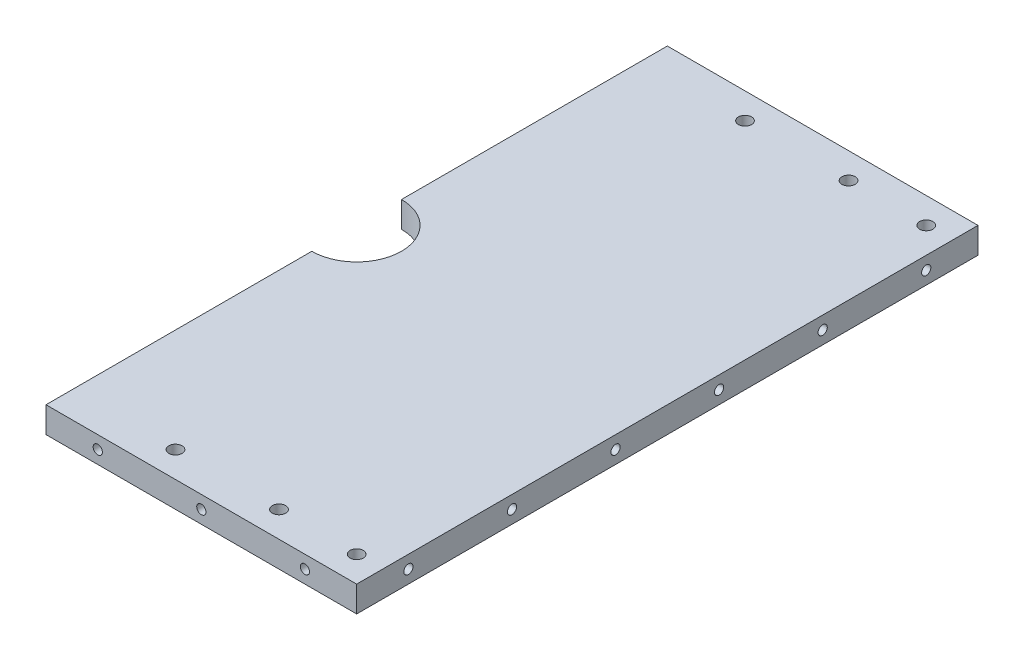
ISO-10303-21;
HEADER;
FILE_DESCRIPTION(('STEP AP214'),'2;1');
FILE_NAME('part.step','',(''),(''),'','','');
FILE_SCHEMA(('AUTOMOTIVE_DESIGN { 1 0 10303 214 1 1 1 1 }'));
ENDSEC;
DATA;
#1=APPLICATION_CONTEXT('core data for automotive mechanical design processes');
#2=APPLICATION_PROTOCOL_DEFINITION('international standard','automotive_design',2000,#1);
#3=PRODUCT_CONTEXT('',#1,'mechanical');
#4=PRODUCT('Part','Part','',(#3));
#5=PRODUCT_RELATED_PRODUCT_CATEGORY('part','',(#4));
#6=PRODUCT_DEFINITION_FORMATION('','',#4);
#7=PRODUCT_DEFINITION_CONTEXT('part definition',#1,'design');
#8=PRODUCT_DEFINITION('design','',#6,#7);
#9=PRODUCT_DEFINITION_SHAPE('','',#8);
#10=(LENGTH_UNIT() NAMED_UNIT(*) SI_UNIT(.MILLI.,.METRE.));
#11=(NAMED_UNIT(*) PLANE_ANGLE_UNIT() SI_UNIT($,.RADIAN.));
#12=(NAMED_UNIT(*) SI_UNIT($,.STERADIAN.) SOLID_ANGLE_UNIT());
#13=UNCERTAINTY_MEASURE_WITH_UNIT(LENGTH_MEASURE(1.E-05),#10,'distance_accuracy_value','');
#14=(GEOMETRIC_REPRESENTATION_CONTEXT(3) GLOBAL_UNCERTAINTY_ASSIGNED_CONTEXT((#13)) GLOBAL_UNIT_ASSIGNED_CONTEXT((#10,
#11,#12)) REPRESENTATION_CONTEXT('',''));
#15=CARTESIAN_POINT('',(0.,0.,0.));
#16=DIRECTION('',(0.,0.,1.));
#17=DIRECTION('',(1.,0.,0.));
#18=AXIS2_PLACEMENT_3D('',#15,#16,#17);
#19=CARTESIAN_POINT('',(0.,6.35,0.));
#20=DIRECTION('',(0.,1.,0.));
#21=DIRECTION('',(0.,0.,1.));
#22=AXIS2_PLACEMENT_3D('',#19,#20,#21);
#23=PLANE('',#22);
#24=CARTESIAN_POINT('',(50.8,6.35,69.85));
#25=DIRECTION('',(0.,1.,0.));
#26=DIRECTION('',(0.,0.,-1.));
#27=AXIS2_PLACEMENT_3D('',#24,#25,#26);
#28=CIRCLE('',#27,1.63194999999999);
#29=CARTESIAN_POINT('',(50.8,6.35,68.21805));
#30=VERTEX_POINT('',#29);
#31=EDGE_CURVE('E423',#30,#30,#28,.T.);
#32=ORIENTED_EDGE('',*,*,#31,.F.);
#33=EDGE_LOOP('',(#32));
#34=FACE_BOUND('',#33,.T.);
#35=CARTESIAN_POINT('',(50.8,6.35,-69.85));
#36=DIRECTION('',(0.,1.,0.));
#37=DIRECTION('',(0.,0.,1.));
#38=AXIS2_PLACEMENT_3D('',#35,#36,#37);
#39=CIRCLE('',#38,1.63194999999999);
#40=CARTESIAN_POINT('',(50.8,6.35,-68.21805));
#41=VERTEX_POINT('',#40);
#42=EDGE_CURVE('E439',#41,#41,#39,.T.);
#43=ORIENTED_EDGE('',*,*,#42,.F.);
#44=EDGE_LOOP('',(#43));
#45=FACE_BOUND('',#44,.T.);
#46=CARTESIAN_POINT('',(69.85,6.35,-69.85));
#47=DIRECTION('',(0.,1.,0.));
#48=DIRECTION('',(0.,0.,1.));
#49=AXIS2_PLACEMENT_3D('',#46,#47,#48);
#50=CIRCLE('',#49,1.63194999999999);
#51=CARTESIAN_POINT('',(69.85,6.35,-68.21805));
#52=VERTEX_POINT('',#51);
#53=EDGE_CURVE('E143',#52,#52,#50,.T.);
#54=ORIENTED_EDGE('',*,*,#53,.F.);
#55=EDGE_LOOP('',(#54));
#56=FACE_BOUND('',#55,.T.);
#57=DIRECTION('',(0.,0.,1.));
#58=VECTOR('',#57,1.);
#59=CARTESIAN_POINT('',(0.,6.35,-76.2));
#60=LINE('',#59,#58);
#61=CARTESIAN_POINT('',(0.,6.35,-76.2));
#62=VERTEX_POINT('',#61);
#63=CARTESIAN_POINT('',(0.,6.35,-11.));
#64=VERTEX_POINT('',#63);
#65=EDGE_CURVE('E155',#62,#64,#60,.T.);
#66=ORIENTED_EDGE('',*,*,#65,.T.);
#67=CARTESIAN_POINT('',(0.,6.35,0.));
#68=DIRECTION('',(0.,-1.,0.));
#69=DIRECTION('',(0.,0.,1.));
#70=AXIS2_PLACEMENT_3D('',#67,#68,#69);
#71=CIRCLE('',#70,11.);
#72=CARTESIAN_POINT('',(0.,6.35,11.));
#73=VERTEX_POINT('',#72);
#74=EDGE_CURVE('E101',#64,#73,#71,.T.);
#75=ORIENTED_EDGE('',*,*,#74,.T.);
#76=DIRECTION('',(0.,0.,1.));
#77=VECTOR('',#76,1.);
#78=CARTESIAN_POINT('',(0.,6.35,11.));
#79=LINE('',#78,#77);
#80=CARTESIAN_POINT('',(0.,6.35,76.2));
#81=VERTEX_POINT('',#80);
#82=EDGE_CURVE('E116',#73,#81,#79,.T.);
#83=ORIENTED_EDGE('',*,*,#82,.T.);
#84=DIRECTION('',(1.,0.,0.));
#85=VECTOR('',#84,1.);
#86=CARTESIAN_POINT('',(0.,6.35,76.2));
#87=LINE('',#86,#85);
#88=CARTESIAN_POINT('',(76.2,6.35,76.2));
#89=VERTEX_POINT('',#88);
#90=EDGE_CURVE('E110',#81,#89,#87,.T.);
#91=ORIENTED_EDGE('',*,*,#90,.T.);
#92=DIRECTION('',(0.,0.,-1.));
#93=VECTOR('',#92,1.);
#94=CARTESIAN_POINT('',(76.2,6.35,-76.2));
#95=LINE('',#94,#93);
#96=CARTESIAN_POINT('',(76.2,6.35,-76.2));
#97=VERTEX_POINT('',#96);
#98=EDGE_CURVE('E114',#89,#97,#95,.T.);
#99=ORIENTED_EDGE('',*,*,#98,.T.);
#100=DIRECTION('',(-1.,0.,0.));
#101=VECTOR('',#100,1.);
#102=CARTESIAN_POINT('',(0.,6.35,-76.2));
#103=LINE('',#102,#101);
#104=EDGE_CURVE('E63',#97,#62,#103,.T.);
#105=ORIENTED_EDGE('',*,*,#104,.T.);
#106=EDGE_LOOP('',(#66,#75,#83,#91,#99,#105));
#107=FACE_BOUND('',#106,.T.);
#108=CARTESIAN_POINT('',(69.85,6.35,69.85));
#109=DIRECTION('',(0.,1.,0.));
#110=DIRECTION('',(0.,0.,-1.));
#111=AXIS2_PLACEMENT_3D('',#108,#109,#110);
#112=CIRCLE('',#111,1.63194999999999);
#113=CARTESIAN_POINT('',(69.85,6.35,68.21805));
#114=VERTEX_POINT('',#113);
#115=EDGE_CURVE('E447',#114,#114,#112,.T.);
#116=ORIENTED_EDGE('',*,*,#115,.F.);
#117=EDGE_LOOP('',(#116));
#118=FACE_BOUND('',#117,.T.);
#119=CARTESIAN_POINT('',(25.4,6.35,-69.85));
#120=DIRECTION('',(0.,1.,0.));
#121=DIRECTION('',(0.,0.,1.));
#122=AXIS2_PLACEMENT_3D('',#119,#120,#121);
#123=CIRCLE('',#122,1.63195);
#124=CARTESIAN_POINT('',(25.4,6.35,-68.21805));
#125=VERTEX_POINT('',#124);
#126=EDGE_CURVE('E431',#125,#125,#123,.T.);
#127=ORIENTED_EDGE('',*,*,#126,.F.);
#128=EDGE_LOOP('',(#127));
#129=FACE_BOUND('',#128,.T.);
#130=CARTESIAN_POINT('',(25.4,6.35,69.85));
#131=DIRECTION('',(0.,1.,0.));
#132=DIRECTION('',(0.,0.,-1.));
#133=AXIS2_PLACEMENT_3D('',#130,#131,#132);
#134=CIRCLE('',#133,1.63195);
#135=CARTESIAN_POINT('',(25.4,6.35,68.21805));
#136=VERTEX_POINT('',#135);
#137=EDGE_CURVE('E415',#136,#136,#134,.T.);
#138=ORIENTED_EDGE('',*,*,#137,.F.);
#139=EDGE_LOOP('',(#138));
#140=FACE_BOUND('',#139,.T.);
#141=ADVANCED_FACE('F45',(#34,#45,#56,#107,#118,#129,#140),#23,.T.);
#142=CARTESIAN_POINT('',(0.,0.,0.));
#143=DIRECTION('',(0.,1.,0.));
#144=DIRECTION('',(0.,0.,1.));
#145=AXIS2_PLACEMENT_3D('',#142,#143,#144);
#146=PLANE('',#145);
#147=DIRECTION('',(0.,0.,1.));
#148=VECTOR('',#147,1.);
#149=CARTESIAN_POINT('',(0.,0.,-76.2));
#150=LINE('',#149,#148);
#151=CARTESIAN_POINT('',(0.,0.,-76.2));
#152=VERTEX_POINT('',#151);
#153=CARTESIAN_POINT('',(0.,0.,-11.));
#154=VERTEX_POINT('',#153);
#155=EDGE_CURVE('E138',#152,#154,#150,.T.);
#156=ORIENTED_EDGE('',*,*,#155,.F.);
#157=DIRECTION('',(-1.,0.,0.));
#158=VECTOR('',#157,1.);
#159=CARTESIAN_POINT('',(0.,0.,-76.2));
#160=LINE('',#159,#158);
#161=CARTESIAN_POINT('',(76.2,0.,-76.2));
#162=VERTEX_POINT('',#161);
#163=EDGE_CURVE('E93',#162,#152,#160,.T.);
#164=ORIENTED_EDGE('',*,*,#163,.F.);
#165=DIRECTION('',(0.,0.,-1.));
#166=VECTOR('',#165,1.);
#167=CARTESIAN_POINT('',(76.2,0.,-76.2));
#168=LINE('',#167,#166);
#169=CARTESIAN_POINT('',(76.2,0.,76.2));
#170=VERTEX_POINT('',#169);
#171=EDGE_CURVE('E87',#170,#162,#168,.T.);
#172=ORIENTED_EDGE('',*,*,#171,.F.);
#173=DIRECTION('',(1.,0.,0.));
#174=VECTOR('',#173,1.);
#175=CARTESIAN_POINT('',(0.,0.,76.2));
#176=LINE('',#175,#174);
#177=CARTESIAN_POINT('',(0.,0.,76.2));
#178=VERTEX_POINT('',#177);
#179=EDGE_CURVE('E125',#178,#170,#176,.T.);
#180=ORIENTED_EDGE('',*,*,#179,.F.);
#181=DIRECTION('',(0.,0.,1.));
#182=VECTOR('',#181,1.);
#183=CARTESIAN_POINT('',(0.,0.,11.));
#184=LINE('',#183,#182);
#185=CARTESIAN_POINT('',(0.,0.,11.));
#186=VERTEX_POINT('',#185);
#187=EDGE_CURVE('E146',#186,#178,#184,.T.);
#188=ORIENTED_EDGE('',*,*,#187,.F.);
#189=CARTESIAN_POINT('',(0.,0.,0.));
#190=DIRECTION('',(0.,-1.,0.));
#191=DIRECTION('',(0.,0.,1.));
#192=AXIS2_PLACEMENT_3D('',#189,#190,#191);
#193=CIRCLE('',#192,11.);
#194=EDGE_CURVE('E142',#154,#186,#193,.T.);
#195=ORIENTED_EDGE('',*,*,#194,.F.);
#196=EDGE_LOOP('',(#156,#164,#172,#180,#188,#195));
#197=FACE_BOUND('',#196,.T.);
#198=CARTESIAN_POINT('',(69.85,0.,-69.85));
#199=DIRECTION('',(0.,1.,0.));
#200=DIRECTION('',(0.,0.,1.));
#201=AXIS2_PLACEMENT_3D('',#198,#199,#200);
#202=CIRCLE('',#201,1.63194999999999);
#203=CARTESIAN_POINT('',(69.85,0.,-68.21805));
#204=VERTEX_POINT('',#203);
#205=EDGE_CURVE('E451',#204,#204,#202,.T.);
#206=ORIENTED_EDGE('',*,*,#205,.T.);
#207=EDGE_LOOP('',(#206));
#208=FACE_BOUND('',#207,.T.);
#209=CARTESIAN_POINT('',(69.85,0.,69.85));
#210=DIRECTION('',(0.,1.,0.));
#211=DIRECTION('',(0.,0.,-1.));
#212=AXIS2_PLACEMENT_3D('',#209,#210,#211);
#213=CIRCLE('',#212,1.63194999999999);
#214=CARTESIAN_POINT('',(69.85,0.,68.21805));
#215=VERTEX_POINT('',#214);
#216=EDGE_CURVE('E443',#215,#215,#213,.T.);
#217=ORIENTED_EDGE('',*,*,#216,.T.);
#218=EDGE_LOOP('',(#217));
#219=FACE_BOUND('',#218,.T.);
#220=CARTESIAN_POINT('',(50.8,0.,-69.85));
#221=DIRECTION('',(0.,1.,0.));
#222=DIRECTION('',(0.,0.,1.));
#223=AXIS2_PLACEMENT_3D('',#220,#221,#222);
#224=CIRCLE('',#223,1.63194999999999);
#225=CARTESIAN_POINT('',(50.8,0.,-68.21805));
#226=VERTEX_POINT('',#225);
#227=EDGE_CURVE('E435',#226,#226,#224,.T.);
#228=ORIENTED_EDGE('',*,*,#227,.T.);
#229=EDGE_LOOP('',(#228));
#230=FACE_BOUND('',#229,.T.);
#231=CARTESIAN_POINT('',(25.4,0.,-69.85));
#232=DIRECTION('',(0.,1.,0.));
#233=DIRECTION('',(0.,0.,1.));
#234=AXIS2_PLACEMENT_3D('',#231,#232,#233);
#235=CIRCLE('',#234,1.63195);
#236=CARTESIAN_POINT('',(25.4,0.,-68.21805));
#237=VERTEX_POINT('',#236);
#238=EDGE_CURVE('E427',#237,#237,#235,.T.);
#239=ORIENTED_EDGE('',*,*,#238,.T.);
#240=EDGE_LOOP('',(#239));
#241=FACE_BOUND('',#240,.T.);
#242=CARTESIAN_POINT('',(50.8,0.,69.85));
#243=DIRECTION('',(0.,1.,0.));
#244=DIRECTION('',(0.,0.,-1.));
#245=AXIS2_PLACEMENT_3D('',#242,#243,#244);
#246=CIRCLE('',#245,1.63194999999999);
#247=CARTESIAN_POINT('',(50.8,0.,68.21805));
#248=VERTEX_POINT('',#247);
#249=EDGE_CURVE('E419',#248,#248,#246,.T.);
#250=ORIENTED_EDGE('',*,*,#249,.T.);
#251=EDGE_LOOP('',(#250));
#252=FACE_BOUND('',#251,.T.);
#253=CARTESIAN_POINT('',(25.4,0.,69.85));
#254=DIRECTION('',(0.,1.,0.));
#255=DIRECTION('',(0.,0.,-1.));
#256=AXIS2_PLACEMENT_3D('',#253,#254,#255);
#257=CIRCLE('',#256,1.63195);
#258=CARTESIAN_POINT('',(25.4,0.,68.21805));
#259=VERTEX_POINT('',#258);
#260=EDGE_CURVE('E414',#259,#259,#257,.T.);
#261=ORIENTED_EDGE('',*,*,#260,.T.);
#262=EDGE_LOOP('',(#261));
#263=FACE_BOUND('',#262,.T.);
#264=ADVANCED_FACE('F168',(#197,#208,#219,#230,#241,#252,#263),#146,.F.);
#265=CARTESIAN_POINT('',(0.,6.35,-76.2));
#266=DIRECTION('',(1.,0.,0.));
#267=DIRECTION('',(0.,0.,-1.));
#268=AXIS2_PLACEMENT_3D('',#265,#266,#267);
#269=PLANE('',#268);
#270=ORIENTED_EDGE('',*,*,#155,.T.);
#271=DIRECTION('',(0.,-1.,0.));
#272=VECTOR('',#271,1.);
#273=CARTESIAN_POINT('',(0.,6.35,-11.));
#274=LINE('',#273,#272);
#275=EDGE_CURVE('E11',#64,#154,#274,.T.);
#276=ORIENTED_EDGE('',*,*,#275,.F.);
#277=ORIENTED_EDGE('',*,*,#65,.F.);
#278=DIRECTION('',(0.,-1.,0.));
#279=VECTOR('',#278,1.);
#280=CARTESIAN_POINT('',(0.,6.35,-76.2));
#281=LINE('',#280,#279);
#282=EDGE_CURVE('E134',#62,#152,#281,.T.);
#283=ORIENTED_EDGE('',*,*,#282,.T.);
#284=EDGE_LOOP('',(#270,#276,#277,#283));
#285=FACE_BOUND('',#284,.T.);
#286=ADVANCED_FACE('F47',(#285),#269,.F.);
#287=CARTESIAN_POINT('',(0.,6.35,0.));
#288=DIRECTION('',(0.,-1.,0.));
#289=DIRECTION('',(0.,0.,-1.));
#290=AXIS2_PLACEMENT_3D('',#287,#288,#289);
#291=CYLINDRICAL_SURFACE('',#290,11.);
#292=ORIENTED_EDGE('',*,*,#194,.T.);
#293=DIRECTION('',(0.,-1.,0.));
#294=VECTOR('',#293,1.);
#295=CARTESIAN_POINT('',(0.,6.35,11.));
#296=LINE('',#295,#294);
#297=EDGE_CURVE('E55',#73,#186,#296,.T.);
#298=ORIENTED_EDGE('',*,*,#297,.F.);
#299=ORIENTED_EDGE('',*,*,#74,.F.);
#300=ORIENTED_EDGE('',*,*,#275,.T.);
#301=EDGE_LOOP('',(#292,#298,#299,#300));
#302=FACE_BOUND('',#301,.T.);
#303=ADVANCED_FACE('F530',(#302),#291,.F.);
#304=CARTESIAN_POINT('',(0.,6.35,11.));
#305=DIRECTION('',(1.,0.,0.));
#306=DIRECTION('',(0.,0.,-1.));
#307=AXIS2_PLACEMENT_3D('',#304,#305,#306);
#308=PLANE('',#307);
#309=ORIENTED_EDGE('',*,*,#187,.T.);
#310=DIRECTION('',(0.,-1.,0.));
#311=VECTOR('',#310,1.);
#312=CARTESIAN_POINT('',(0.,6.35,76.2));
#313=LINE('',#312,#311);
#314=EDGE_CURVE('E127',#81,#178,#313,.T.);
#315=ORIENTED_EDGE('',*,*,#314,.F.);
#316=ORIENTED_EDGE('',*,*,#82,.F.);
#317=ORIENTED_EDGE('',*,*,#297,.T.);
#318=EDGE_LOOP('',(#309,#315,#316,#317));
#319=FACE_BOUND('',#318,.T.);
#320=ADVANCED_FACE('F165',(#319),#308,.F.);
#321=CARTESIAN_POINT('',(0.,6.35,76.2));
#322=DIRECTION('',(0.,0.,-1.));
#323=DIRECTION('',(-1.,0.,0.));
#324=AXIS2_PLACEMENT_3D('',#321,#322,#323);
#325=PLANE('',#324);
#326=CARTESIAN_POINT('',(12.7,3.175,76.2));
#327=DIRECTION('',(0.,0.,1.));
#328=DIRECTION('',(1.,0.,0.));
#329=AXIS2_PLACEMENT_3D('',#326,#327,#328);
#330=CIRCLE('',#329,1.13029999999999);
#331=CARTESIAN_POINT('',(13.8303,3.175,76.2));
#332=VERTEX_POINT('',#331);
#333=EDGE_CURVE('E342',#332,#332,#330,.T.);
#334=ORIENTED_EDGE('',*,*,#333,.F.);
#335=EDGE_LOOP('',(#334));
#336=FACE_BOUND('',#335,.T.);
#337=CARTESIAN_POINT('',(38.1,3.175,76.2));
#338=DIRECTION('',(0.,0.,1.));
#339=DIRECTION('',(1.,0.,0.));
#340=AXIS2_PLACEMENT_3D('',#337,#338,#339);
#341=CIRCLE('',#340,1.13029999999999);
#342=CARTESIAN_POINT('',(39.2303,3.175,76.2));
#343=VERTEX_POINT('',#342);
#344=EDGE_CURVE('E350',#343,#343,#341,.T.);
#345=ORIENTED_EDGE('',*,*,#344,.F.);
#346=EDGE_LOOP('',(#345));
#347=FACE_BOUND('',#346,.T.);
#348=CARTESIAN_POINT('',(63.5,3.175,76.2));
#349=DIRECTION('',(0.,0.,1.));
#350=DIRECTION('',(1.,0.,0.));
#351=AXIS2_PLACEMENT_3D('',#348,#349,#350);
#352=CIRCLE('',#351,1.13029999999999);
#353=CARTESIAN_POINT('',(64.6303,3.175,76.2));
#354=VERTEX_POINT('',#353);
#355=EDGE_CURVE('E358',#354,#354,#352,.T.);
#356=ORIENTED_EDGE('',*,*,#355,.F.);
#357=EDGE_LOOP('',(#356));
#358=FACE_BOUND('',#357,.T.);
#359=ORIENTED_EDGE('',*,*,#179,.T.);
#360=DIRECTION('',(0.,-1.,0.));
#361=VECTOR('',#360,1.);
#362=CARTESIAN_POINT('',(76.2,6.35,76.2));
#363=LINE('',#362,#361);
#364=EDGE_CURVE('E122',#89,#170,#363,.T.);
#365=ORIENTED_EDGE('',*,*,#364,.F.);
#366=ORIENTED_EDGE('',*,*,#90,.F.);
#367=ORIENTED_EDGE('',*,*,#314,.T.);
#368=EDGE_LOOP('',(#359,#365,#366,#367));
#369=FACE_BOUND('',#368,.T.);
#370=ADVANCED_FACE('F123',(#336,#347,#358,#369),#325,.F.);
#371=CARTESIAN_POINT('',(76.2,6.35,-76.2));
#372=DIRECTION('',(-1.,0.,0.));
#373=DIRECTION('',(0.,0.,1.));
#374=AXIS2_PLACEMENT_3D('',#371,#372,#373);
#375=PLANE('',#374);
#376=CARTESIAN_POINT('',(76.2,3.175,-63.5));
#377=DIRECTION('',(1.,0.,0.));
#378=DIRECTION('',(0.,0.,-1.));
#379=AXIS2_PLACEMENT_3D('',#376,#377,#378);
#380=CIRCLE('',#379,1.1303);
#381=CARTESIAN_POINT('',(76.2,3.175,-64.6303));
#382=VERTEX_POINT('',#381);
#383=EDGE_CURVE('E366',#382,#382,#380,.T.);
#384=ORIENTED_EDGE('',*,*,#383,.F.);
#385=EDGE_LOOP('',(#384));
#386=FACE_BOUND('',#385,.T.);
#387=CARTESIAN_POINT('',(76.2,3.175,-38.1));
#388=DIRECTION('',(1.,0.,0.));
#389=DIRECTION('',(0.,0.,-1.));
#390=AXIS2_PLACEMENT_3D('',#387,#388,#389);
#391=CIRCLE('',#390,1.1303);
#392=CARTESIAN_POINT('',(76.2,3.175,-39.2303));
#393=VERTEX_POINT('',#392);
#394=EDGE_CURVE('E374',#393,#393,#391,.T.);
#395=ORIENTED_EDGE('',*,*,#394,.F.);
#396=EDGE_LOOP('',(#395));
#397=FACE_BOUND('',#396,.T.);
#398=CARTESIAN_POINT('',(76.2,3.175,-12.7));
#399=DIRECTION('',(1.,0.,0.));
#400=DIRECTION('',(0.,0.,-1.));
#401=AXIS2_PLACEMENT_3D('',#398,#399,#400);
#402=CIRCLE('',#401,1.1303);
#403=CARTESIAN_POINT('',(76.2,3.175,-13.8303));
#404=VERTEX_POINT('',#403);
#405=EDGE_CURVE('E382',#404,#404,#402,.T.);
#406=ORIENTED_EDGE('',*,*,#405,.F.);
#407=EDGE_LOOP('',(#406));
#408=FACE_BOUND('',#407,.T.);
#409=CARTESIAN_POINT('',(76.2,3.175,12.7));
#410=DIRECTION('',(1.,0.,0.));
#411=DIRECTION('',(0.,0.,-1.));
#412=AXIS2_PLACEMENT_3D('',#409,#410,#411);
#413=CIRCLE('',#412,1.1303);
#414=CARTESIAN_POINT('',(76.2,3.175,11.5697));
#415=VERTEX_POINT('',#414);
#416=EDGE_CURVE('E390',#415,#415,#413,.T.);
#417=ORIENTED_EDGE('',*,*,#416,.F.);
#418=EDGE_LOOP('',(#417));
#419=FACE_BOUND('',#418,.T.);
#420=CARTESIAN_POINT('',(76.2,3.175,38.1));
#421=DIRECTION('',(1.,0.,0.));
#422=DIRECTION('',(0.,0.,-1.));
#423=AXIS2_PLACEMENT_3D('',#420,#421,#422);
#424=CIRCLE('',#423,1.1303);
#425=CARTESIAN_POINT('',(76.2,3.175,36.9697));
#426=VERTEX_POINT('',#425);
#427=EDGE_CURVE('E398',#426,#426,#424,.T.);
#428=ORIENTED_EDGE('',*,*,#427,.F.);
#429=EDGE_LOOP('',(#428));
#430=FACE_BOUND('',#429,.T.);
#431=CARTESIAN_POINT('',(76.2,3.175,63.5));
#432=DIRECTION('',(1.,0.,0.));
#433=DIRECTION('',(0.,0.,-1.));
#434=AXIS2_PLACEMENT_3D('',#431,#432,#433);
#435=CIRCLE('',#434,1.1303);
#436=CARTESIAN_POINT('',(76.2,3.175,62.3697));
#437=VERTEX_POINT('',#436);
#438=EDGE_CURVE('E406',#437,#437,#435,.T.);
#439=ORIENTED_EDGE('',*,*,#438,.F.);
#440=EDGE_LOOP('',(#439));
#441=FACE_BOUND('',#440,.T.);
#442=ORIENTED_EDGE('',*,*,#171,.T.);
#443=DIRECTION('',(0.,-1.,0.));
#444=VECTOR('',#443,1.);
#445=CARTESIAN_POINT('',(76.2,6.35,-76.2));
#446=LINE('',#445,#444);
#447=EDGE_CURVE('E128',#97,#162,#446,.T.);
#448=ORIENTED_EDGE('',*,*,#447,.F.);
#449=ORIENTED_EDGE('',*,*,#98,.F.);
#450=ORIENTED_EDGE('',*,*,#364,.T.);
#451=EDGE_LOOP('',(#442,#448,#449,#450));
#452=FACE_BOUND('',#451,.T.);
#453=ADVANCED_FACE('F130',(#386,#397,#408,#419,#430,#441,#452),#375,.F.);
#454=CARTESIAN_POINT('',(0.,6.35,-76.2));
#455=DIRECTION('',(0.,0.,1.));
#456=DIRECTION('',(1.,0.,0.));
#457=AXIS2_PLACEMENT_3D('',#454,#455,#456);
#458=PLANE('',#457);
#459=CARTESIAN_POINT('',(12.7,3.175,-76.2));
#460=DIRECTION('',(0.,0.,-1.));
#461=DIRECTION('',(-1.,0.,0.));
#462=AXIS2_PLACEMENT_3D('',#459,#460,#461);
#463=CIRCLE('',#462,1.13029999999999);
#464=CARTESIAN_POINT('',(11.5697,3.175,-76.2));
#465=VERTEX_POINT('',#464);
#466=EDGE_CURVE('E320',#465,#465,#463,.T.);
#467=ORIENTED_EDGE('',*,*,#466,.F.);
#468=EDGE_LOOP('',(#467));
#469=FACE_BOUND('',#468,.T.);
#470=CARTESIAN_POINT('',(38.1,3.175,-76.2));
#471=DIRECTION('',(0.,0.,-1.));
#472=DIRECTION('',(-1.,0.,0.));
#473=AXIS2_PLACEMENT_3D('',#470,#471,#472);
#474=CIRCLE('',#473,1.13029999999999);
#475=CARTESIAN_POINT('',(36.9697,3.175,-76.2));
#476=VERTEX_POINT('',#475);
#477=EDGE_CURVE('E324',#476,#476,#474,.T.);
#478=ORIENTED_EDGE('',*,*,#477,.F.);
#479=EDGE_LOOP('',(#478));
#480=FACE_BOUND('',#479,.T.);
#481=CARTESIAN_POINT('',(63.5,3.175,-76.2));
#482=DIRECTION('',(0.,0.,-1.));
#483=DIRECTION('',(-1.,0.,0.));
#484=AXIS2_PLACEMENT_3D('',#481,#482,#483);
#485=CIRCLE('',#484,1.13029999999999);
#486=CARTESIAN_POINT('',(62.3697,3.175,-76.2));
#487=VERTEX_POINT('',#486);
#488=EDGE_CURVE('E334',#487,#487,#485,.T.);
#489=ORIENTED_EDGE('',*,*,#488,.F.);
#490=EDGE_LOOP('',(#489));
#491=FACE_BOUND('',#490,.T.);
#492=ORIENTED_EDGE('',*,*,#163,.T.);
#493=ORIENTED_EDGE('',*,*,#282,.F.);
#494=ORIENTED_EDGE('',*,*,#104,.F.);
#495=ORIENTED_EDGE('',*,*,#447,.T.);
#496=EDGE_LOOP('',(#492,#493,#494,#495));
#497=FACE_BOUND('',#496,.T.);
#498=ADVANCED_FACE('F173',(#469,#480,#491,#497),#458,.F.);
#499=CARTESIAN_POINT('',(69.85,6.35,-69.85));
#500=DIRECTION('',(0.,-1.,0.));
#501=DIRECTION('',(0.,0.,-1.));
#502=AXIS2_PLACEMENT_3D('',#499,#500,#501);
#503=CYLINDRICAL_SURFACE('',#502,1.63194999999999);
#504=ORIENTED_EDGE('',*,*,#53,.T.);
#505=EDGE_LOOP('',(#504));
#506=FACE_BOUND('',#505,.T.);
#507=ORIENTED_EDGE('',*,*,#205,.F.);
#508=EDGE_LOOP('',(#507));
#509=FACE_BOUND('',#508,.T.);
#510=ADVANCED_FACE('F175',(#506,#509),#503,.F.);
#511=CARTESIAN_POINT('',(69.85,6.35,69.85));
#512=DIRECTION('',(0.,-1.,0.));
#513=DIRECTION('',(0.,0.,-1.));
#514=AXIS2_PLACEMENT_3D('',#511,#512,#513);
#515=CYLINDRICAL_SURFACE('',#514,1.63194999999999);
#516=ORIENTED_EDGE('',*,*,#115,.T.);
#517=EDGE_LOOP('',(#516));
#518=FACE_BOUND('',#517,.T.);
#519=ORIENTED_EDGE('',*,*,#216,.F.);
#520=EDGE_LOOP('',(#519));
#521=FACE_BOUND('',#520,.T.);
#522=ADVANCED_FACE('F182',(#518,#521),#515,.F.);
#523=CARTESIAN_POINT('',(50.8,6.35,-69.85));
#524=DIRECTION('',(0.,-1.,0.));
#525=DIRECTION('',(0.,0.,-1.));
#526=AXIS2_PLACEMENT_3D('',#523,#524,#525);
#527=CYLINDRICAL_SURFACE('',#526,1.63194999999999);
#528=ORIENTED_EDGE('',*,*,#42,.T.);
#529=EDGE_LOOP('',(#528));
#530=FACE_BOUND('',#529,.T.);
#531=ORIENTED_EDGE('',*,*,#227,.F.);
#532=EDGE_LOOP('',(#531));
#533=FACE_BOUND('',#532,.T.);
#534=ADVANCED_FACE('F201',(#530,#533),#527,.F.);
#535=CARTESIAN_POINT('',(25.4,6.35,-69.85));
#536=DIRECTION('',(0.,-1.,0.));
#537=DIRECTION('',(0.,0.,-1.));
#538=AXIS2_PLACEMENT_3D('',#535,#536,#537);
#539=CYLINDRICAL_SURFACE('',#538,1.63195);
#540=ORIENTED_EDGE('',*,*,#126,.T.);
#541=EDGE_LOOP('',(#540));
#542=FACE_BOUND('',#541,.T.);
#543=ORIENTED_EDGE('',*,*,#238,.F.);
#544=EDGE_LOOP('',(#543));
#545=FACE_BOUND('',#544,.T.);
#546=ADVANCED_FACE('F205',(#542,#545),#539,.F.);
#547=CARTESIAN_POINT('',(50.8,6.35,69.85));
#548=DIRECTION('',(0.,-1.,0.));
#549=DIRECTION('',(0.,0.,-1.));
#550=AXIS2_PLACEMENT_3D('',#547,#548,#549);
#551=CYLINDRICAL_SURFACE('',#550,1.63194999999999);
#552=ORIENTED_EDGE('',*,*,#31,.T.);
#553=EDGE_LOOP('',(#552));
#554=FACE_BOUND('',#553,.T.);
#555=ORIENTED_EDGE('',*,*,#249,.F.);
#556=EDGE_LOOP('',(#555));
#557=FACE_BOUND('',#556,.T.);
#558=ADVANCED_FACE('F209',(#554,#557),#551,.F.);
#559=CARTESIAN_POINT('',(25.4,6.35,69.85));
#560=DIRECTION('',(0.,-1.,0.));
#561=DIRECTION('',(0.,0.,-1.));
#562=AXIS2_PLACEMENT_3D('',#559,#560,#561);
#563=CYLINDRICAL_SURFACE('',#562,1.63195);
#564=ORIENTED_EDGE('',*,*,#137,.T.);
#565=EDGE_LOOP('',(#564));
#566=FACE_BOUND('',#565,.T.);
#567=ORIENTED_EDGE('',*,*,#260,.F.);
#568=EDGE_LOOP('',(#567));
#569=FACE_BOUND('',#568,.T.);
#570=ADVANCED_FACE('F213',(#566,#569),#563,.F.);
#571=CARTESIAN_POINT('',(68.6,3.175,63.5));
#572=DIRECTION('',(1.,0.,0.));
#573=DIRECTION('',(0.,0.,-1.));
#574=AXIS2_PLACEMENT_3D('',#571,#572,#573);
#575=CONICAL_SURFACE('',#574,1.1303,1.02974425867665);
#576=CARTESIAN_POINT('',(67.9208472423132,3.175,63.5));
#577=VERTEX_POINT('',#576);
#578=VERTEX_LOOP('',#577);
#579=FACE_BOUND('',#578,.T.);
#580=CARTESIAN_POINT('',(68.6,3.175,63.5));
#581=DIRECTION('',(1.,0.,0.));
#582=DIRECTION('',(0.,0.,-1.));
#583=AXIS2_PLACEMENT_3D('',#580,#581,#582);
#584=CIRCLE('',#583,1.1303);
#585=CARTESIAN_POINT('',(68.6,3.175,62.3697));
#586=VERTEX_POINT('',#585);
#587=EDGE_CURVE('E410',#586,#586,#584,.T.);
#588=ORIENTED_EDGE('',*,*,#587,.T.);
#589=EDGE_LOOP('',(#588));
#590=FACE_BOUND('',#589,.T.);
#591=ADVANCED_FACE('F217',(#579,#590),#575,.F.);
#592=CARTESIAN_POINT('',(76.2,3.175,63.5));
#593=DIRECTION('',(1.,0.,0.));
#594=DIRECTION('',(0.,0.,-1.));
#595=AXIS2_PLACEMENT_3D('',#592,#593,#594);
#596=CYLINDRICAL_SURFACE('',#595,1.1303);
#597=ORIENTED_EDGE('',*,*,#587,.F.);
#598=EDGE_LOOP('',(#597));
#599=FACE_BOUND('',#598,.T.);
#600=ORIENTED_EDGE('',*,*,#438,.T.);
#601=EDGE_LOOP('',(#600));
#602=FACE_BOUND('',#601,.T.);
#603=ADVANCED_FACE('F221',(#599,#602),#596,.F.);
#604=CARTESIAN_POINT('',(68.6,3.175,38.1));
#605=DIRECTION('',(1.,0.,0.));
#606=DIRECTION('',(0.,0.,-1.));
#607=AXIS2_PLACEMENT_3D('',#604,#605,#606);
#608=CONICAL_SURFACE('',#607,1.1303,1.02974425867665);
#609=CARTESIAN_POINT('',(67.9208472423132,3.175,38.1));
#610=VERTEX_POINT('',#609);
#611=VERTEX_LOOP('',#610);
#612=FACE_BOUND('',#611,.T.);
#613=CARTESIAN_POINT('',(68.6,3.175,38.1));
#614=DIRECTION('',(1.,0.,0.));
#615=DIRECTION('',(0.,0.,-1.));
#616=AXIS2_PLACEMENT_3D('',#613,#614,#615);
#617=CIRCLE('',#616,1.1303);
#618=CARTESIAN_POINT('',(68.6,3.175,36.9697));
#619=VERTEX_POINT('',#618);
#620=EDGE_CURVE('E402',#619,#619,#617,.T.);
#621=ORIENTED_EDGE('',*,*,#620,.T.);
#622=EDGE_LOOP('',(#621));
#623=FACE_BOUND('',#622,.T.);
#624=ADVANCED_FACE('F225',(#612,#623),#608,.F.);
#625=CARTESIAN_POINT('',(76.2,3.175,38.1));
#626=DIRECTION('',(1.,0.,0.));
#627=DIRECTION('',(0.,0.,-1.));
#628=AXIS2_PLACEMENT_3D('',#625,#626,#627);
#629=CYLINDRICAL_SURFACE('',#628,1.1303);
#630=ORIENTED_EDGE('',*,*,#620,.F.);
#631=EDGE_LOOP('',(#630));
#632=FACE_BOUND('',#631,.T.);
#633=ORIENTED_EDGE('',*,*,#427,.T.);
#634=EDGE_LOOP('',(#633));
#635=FACE_BOUND('',#634,.T.);
#636=ADVANCED_FACE('F229',(#632,#635),#629,.F.);
#637=CARTESIAN_POINT('',(68.6,3.175,12.7));
#638=DIRECTION('',(1.,0.,0.));
#639=DIRECTION('',(0.,0.,-1.));
#640=AXIS2_PLACEMENT_3D('',#637,#638,#639);
#641=CONICAL_SURFACE('',#640,1.1303,1.02974425867665);
#642=CARTESIAN_POINT('',(67.9208472423132,3.175,12.7));
#643=VERTEX_POINT('',#642);
#644=VERTEX_LOOP('',#643);
#645=FACE_BOUND('',#644,.T.);
#646=CARTESIAN_POINT('',(68.6,3.175,12.7));
#647=DIRECTION('',(1.,0.,0.));
#648=DIRECTION('',(0.,0.,-1.));
#649=AXIS2_PLACEMENT_3D('',#646,#647,#648);
#650=CIRCLE('',#649,1.1303);
#651=CARTESIAN_POINT('',(68.6,3.175,11.5697));
#652=VERTEX_POINT('',#651);
#653=EDGE_CURVE('E394',#652,#652,#650,.T.);
#654=ORIENTED_EDGE('',*,*,#653,.T.);
#655=EDGE_LOOP('',(#654));
#656=FACE_BOUND('',#655,.T.);
#657=ADVANCED_FACE('F233',(#645,#656),#641,.F.);
#658=CARTESIAN_POINT('',(76.2,3.175,12.7));
#659=DIRECTION('',(1.,0.,0.));
#660=DIRECTION('',(0.,0.,-1.));
#661=AXIS2_PLACEMENT_3D('',#658,#659,#660);
#662=CYLINDRICAL_SURFACE('',#661,1.1303);
#663=ORIENTED_EDGE('',*,*,#653,.F.);
#664=EDGE_LOOP('',(#663));
#665=FACE_BOUND('',#664,.T.);
#666=ORIENTED_EDGE('',*,*,#416,.T.);
#667=EDGE_LOOP('',(#666));
#668=FACE_BOUND('',#667,.T.);
#669=ADVANCED_FACE('F237',(#665,#668),#662,.F.);
#670=CARTESIAN_POINT('',(68.6,3.175,-12.7));
#671=DIRECTION('',(1.,0.,0.));
#672=DIRECTION('',(0.,0.,-1.));
#673=AXIS2_PLACEMENT_3D('',#670,#671,#672);
#674=CONICAL_SURFACE('',#673,1.1303,1.02974425867665);
#675=CARTESIAN_POINT('',(67.9208472423132,3.175,-12.7));
#676=VERTEX_POINT('',#675);
#677=VERTEX_LOOP('',#676);
#678=FACE_BOUND('',#677,.T.);
#679=CARTESIAN_POINT('',(68.6,3.175,-12.7));
#680=DIRECTION('',(1.,0.,0.));
#681=DIRECTION('',(0.,0.,-1.));
#682=AXIS2_PLACEMENT_3D('',#679,#680,#681);
#683=CIRCLE('',#682,1.1303);
#684=CARTESIAN_POINT('',(68.6,3.175,-13.8303));
#685=VERTEX_POINT('',#684);
#686=EDGE_CURVE('E386',#685,#685,#683,.T.);
#687=ORIENTED_EDGE('',*,*,#686,.T.);
#688=EDGE_LOOP('',(#687));
#689=FACE_BOUND('',#688,.T.);
#690=ADVANCED_FACE('F241',(#678,#689),#674,.F.);
#691=CARTESIAN_POINT('',(76.2,3.175,-12.7));
#692=DIRECTION('',(1.,0.,0.));
#693=DIRECTION('',(0.,0.,-1.));
#694=AXIS2_PLACEMENT_3D('',#691,#692,#693);
#695=CYLINDRICAL_SURFACE('',#694,1.1303);
#696=ORIENTED_EDGE('',*,*,#686,.F.);
#697=EDGE_LOOP('',(#696));
#698=FACE_BOUND('',#697,.T.);
#699=ORIENTED_EDGE('',*,*,#405,.T.);
#700=EDGE_LOOP('',(#699));
#701=FACE_BOUND('',#700,.T.);
#702=ADVANCED_FACE('F245',(#698,#701),#695,.F.);
#703=CARTESIAN_POINT('',(68.6,3.175,-38.1));
#704=DIRECTION('',(1.,0.,0.));
#705=DIRECTION('',(0.,0.,-1.));
#706=AXIS2_PLACEMENT_3D('',#703,#704,#705);
#707=CONICAL_SURFACE('',#706,1.1303,1.02974425867665);
#708=CARTESIAN_POINT('',(67.9208472423131,3.175,-38.1));
#709=VERTEX_POINT('',#708);
#710=VERTEX_LOOP('',#709);
#711=FACE_BOUND('',#710,.T.);
#712=CARTESIAN_POINT('',(68.6,3.175,-38.1));
#713=DIRECTION('',(1.,0.,0.));
#714=DIRECTION('',(0.,0.,-1.));
#715=AXIS2_PLACEMENT_3D('',#712,#713,#714);
#716=CIRCLE('',#715,1.1303);
#717=CARTESIAN_POINT('',(68.6,3.175,-39.2303));
#718=VERTEX_POINT('',#717);
#719=EDGE_CURVE('E378',#718,#718,#716,.T.);
#720=ORIENTED_EDGE('',*,*,#719,.T.);
#721=EDGE_LOOP('',(#720));
#722=FACE_BOUND('',#721,.T.);
#723=ADVANCED_FACE('F249',(#711,#722),#707,.F.);
#724=CARTESIAN_POINT('',(76.2,3.175,-38.1));
#725=DIRECTION('',(1.,0.,0.));
#726=DIRECTION('',(0.,0.,-1.));
#727=AXIS2_PLACEMENT_3D('',#724,#725,#726);
#728=CYLINDRICAL_SURFACE('',#727,1.1303);
#729=ORIENTED_EDGE('',*,*,#719,.F.);
#730=EDGE_LOOP('',(#729));
#731=FACE_BOUND('',#730,.T.);
#732=ORIENTED_EDGE('',*,*,#394,.T.);
#733=EDGE_LOOP('',(#732));
#734=FACE_BOUND('',#733,.T.);
#735=ADVANCED_FACE('F253',(#731,#734),#728,.F.);
#736=CARTESIAN_POINT('',(68.6,3.175,-63.5));
#737=DIRECTION('',(1.,0.,0.));
#738=DIRECTION('',(0.,0.,-1.));
#739=AXIS2_PLACEMENT_3D('',#736,#737,#738);
#740=CONICAL_SURFACE('',#739,1.1303,1.02974425867665);
#741=CARTESIAN_POINT('',(67.9208472423131,3.175,-63.5));
#742=VERTEX_POINT('',#741);
#743=VERTEX_LOOP('',#742);
#744=FACE_BOUND('',#743,.T.);
#745=CARTESIAN_POINT('',(68.6,3.175,-63.5));
#746=DIRECTION('',(1.,0.,0.));
#747=DIRECTION('',(0.,0.,-1.));
#748=AXIS2_PLACEMENT_3D('',#745,#746,#747);
#749=CIRCLE('',#748,1.1303);
#750=CARTESIAN_POINT('',(68.6,3.175,-64.6303));
#751=VERTEX_POINT('',#750);
#752=EDGE_CURVE('E370',#751,#751,#749,.T.);
#753=ORIENTED_EDGE('',*,*,#752,.T.);
#754=EDGE_LOOP('',(#753));
#755=FACE_BOUND('',#754,.T.);
#756=ADVANCED_FACE('F257',(#744,#755),#740,.F.);
#757=CARTESIAN_POINT('',(76.2,3.175,-63.5));
#758=DIRECTION('',(1.,0.,0.));
#759=DIRECTION('',(0.,0.,-1.));
#760=AXIS2_PLACEMENT_3D('',#757,#758,#759);
#761=CYLINDRICAL_SURFACE('',#760,1.1303);
#762=ORIENTED_EDGE('',*,*,#752,.F.);
#763=EDGE_LOOP('',(#762));
#764=FACE_BOUND('',#763,.T.);
#765=ORIENTED_EDGE('',*,*,#383,.T.);
#766=EDGE_LOOP('',(#765));
#767=FACE_BOUND('',#766,.T.);
#768=ADVANCED_FACE('F261',(#764,#767),#761,.F.);
#769=CARTESIAN_POINT('',(63.5,3.175,68.6));
#770=DIRECTION('',(0.,0.,1.));
#771=DIRECTION('',(1.,0.,0.));
#772=AXIS2_PLACEMENT_3D('',#769,#770,#771);
#773=CONICAL_SURFACE('',#772,1.13029999999999,1.02974425867665);
#774=CARTESIAN_POINT('',(63.5,3.175,67.9208472423132));
#775=VERTEX_POINT('',#774);
#776=VERTEX_LOOP('',#775);
#777=FACE_BOUND('',#776,.T.);
#778=CARTESIAN_POINT('',(63.5,3.175,68.6));
#779=DIRECTION('',(0.,0.,1.));
#780=DIRECTION('',(1.,0.,0.));
#781=AXIS2_PLACEMENT_3D('',#778,#779,#780);
#782=CIRCLE('',#781,1.13029999999999);
#783=CARTESIAN_POINT('',(64.6303,3.175,68.6));
#784=VERTEX_POINT('',#783);
#785=EDGE_CURVE('E362',#784,#784,#782,.T.);
#786=ORIENTED_EDGE('',*,*,#785,.T.);
#787=EDGE_LOOP('',(#786));
#788=FACE_BOUND('',#787,.T.);
#789=ADVANCED_FACE('F265',(#777,#788),#773,.F.);
#790=CARTESIAN_POINT('',(63.5,3.175,76.2));
#791=DIRECTION('',(0.,0.,1.));
#792=DIRECTION('',(1.,0.,0.));
#793=AXIS2_PLACEMENT_3D('',#790,#791,#792);
#794=CYLINDRICAL_SURFACE('',#793,1.13029999999999);
#795=ORIENTED_EDGE('',*,*,#785,.F.);
#796=EDGE_LOOP('',(#795));
#797=FACE_BOUND('',#796,.T.);
#798=ORIENTED_EDGE('',*,*,#355,.T.);
#799=EDGE_LOOP('',(#798));
#800=FACE_BOUND('',#799,.T.);
#801=ADVANCED_FACE('F269',(#797,#800),#794,.F.);
#802=CARTESIAN_POINT('',(38.1,3.175,68.6));
#803=DIRECTION('',(0.,0.,1.));
#804=DIRECTION('',(1.,0.,0.));
#805=AXIS2_PLACEMENT_3D('',#802,#803,#804);
#806=CONICAL_SURFACE('',#805,1.13029999999999,1.02974425867665);
#807=CARTESIAN_POINT('',(38.1,3.175,67.9208472423132));
#808=VERTEX_POINT('',#807);
#809=VERTEX_LOOP('',#808);
#810=FACE_BOUND('',#809,.T.);
#811=CARTESIAN_POINT('',(38.1,3.175,68.6));
#812=DIRECTION('',(0.,0.,1.));
#813=DIRECTION('',(1.,0.,0.));
#814=AXIS2_PLACEMENT_3D('',#811,#812,#813);
#815=CIRCLE('',#814,1.13029999999999);
#816=CARTESIAN_POINT('',(39.2303,3.175,68.6));
#817=VERTEX_POINT('',#816);
#818=EDGE_CURVE('E354',#817,#817,#815,.T.);
#819=ORIENTED_EDGE('',*,*,#818,.T.);
#820=EDGE_LOOP('',(#819));
#821=FACE_BOUND('',#820,.T.);
#822=ADVANCED_FACE('F273',(#810,#821),#806,.F.);
#823=CARTESIAN_POINT('',(38.1,3.175,76.2));
#824=DIRECTION('',(0.,0.,1.));
#825=DIRECTION('',(1.,0.,0.));
#826=AXIS2_PLACEMENT_3D('',#823,#824,#825);
#827=CYLINDRICAL_SURFACE('',#826,1.13029999999999);
#828=ORIENTED_EDGE('',*,*,#818,.F.);
#829=EDGE_LOOP('',(#828));
#830=FACE_BOUND('',#829,.T.);
#831=ORIENTED_EDGE('',*,*,#344,.T.);
#832=EDGE_LOOP('',(#831));
#833=FACE_BOUND('',#832,.T.);
#834=ADVANCED_FACE('F277',(#830,#833),#827,.F.);
#835=CARTESIAN_POINT('',(12.7,3.175,68.6));
#836=DIRECTION('',(0.,0.,1.));
#837=DIRECTION('',(1.,0.,0.));
#838=AXIS2_PLACEMENT_3D('',#835,#836,#837);
#839=CONICAL_SURFACE('',#838,1.13029999999999,1.02974425867665);
#840=CARTESIAN_POINT('',(12.7,3.175,67.9208472423132));
#841=VERTEX_POINT('',#840);
#842=VERTEX_LOOP('',#841);
#843=FACE_BOUND('',#842,.T.);
#844=CARTESIAN_POINT('',(12.7,3.175,68.6));
#845=DIRECTION('',(0.,0.,1.));
#846=DIRECTION('',(1.,0.,0.));
#847=AXIS2_PLACEMENT_3D('',#844,#845,#846);
#848=CIRCLE('',#847,1.13029999999999);
#849=CARTESIAN_POINT('',(13.8303,3.175,68.6));
#850=VERTEX_POINT('',#849);
#851=EDGE_CURVE('E346',#850,#850,#848,.T.);
#852=ORIENTED_EDGE('',*,*,#851,.T.);
#853=EDGE_LOOP('',(#852));
#854=FACE_BOUND('',#853,.T.);
#855=ADVANCED_FACE('F281',(#843,#854),#839,.F.);
#856=CARTESIAN_POINT('',(12.7,3.175,76.2));
#857=DIRECTION('',(0.,0.,1.));
#858=DIRECTION('',(1.,0.,0.));
#859=AXIS2_PLACEMENT_3D('',#856,#857,#858);
#860=CYLINDRICAL_SURFACE('',#859,1.13029999999999);
#861=ORIENTED_EDGE('',*,*,#851,.F.);
#862=EDGE_LOOP('',(#861));
#863=FACE_BOUND('',#862,.T.);
#864=ORIENTED_EDGE('',*,*,#333,.T.);
#865=EDGE_LOOP('',(#864));
#866=FACE_BOUND('',#865,.T.);
#867=ADVANCED_FACE('F285',(#863,#866),#860,.F.);
#868=CARTESIAN_POINT('',(63.5,3.175,-68.6));
#869=DIRECTION('',(0.,0.,-1.));
#870=DIRECTION('',(-1.,0.,0.));
#871=AXIS2_PLACEMENT_3D('',#868,#869,#870);
#872=CONICAL_SURFACE('',#871,1.13029999999999,1.02974425867665);
#873=CARTESIAN_POINT('',(63.5,3.175,-67.9208472423132));
#874=VERTEX_POINT('',#873);
#875=VERTEX_LOOP('',#874);
#876=FACE_BOUND('',#875,.T.);
#877=CARTESIAN_POINT('',(63.5,3.175,-68.6));
#878=DIRECTION('',(0.,0.,-1.));
#879=DIRECTION('',(-1.,0.,0.));
#880=AXIS2_PLACEMENT_3D('',#877,#878,#879);
#881=CIRCLE('',#880,1.13029999999999);
#882=CARTESIAN_POINT('',(62.3697,3.175,-68.6));
#883=VERTEX_POINT('',#882);
#884=EDGE_CURVE('E338',#883,#883,#881,.T.);
#885=ORIENTED_EDGE('',*,*,#884,.T.);
#886=EDGE_LOOP('',(#885));
#887=FACE_BOUND('',#886,.T.);
#888=ADVANCED_FACE('F289',(#876,#887),#872,.F.);
#889=CARTESIAN_POINT('',(63.5,3.175,-76.2));
#890=DIRECTION('',(0.,0.,-1.));
#891=DIRECTION('',(-1.,0.,0.));
#892=AXIS2_PLACEMENT_3D('',#889,#890,#891);
#893=CYLINDRICAL_SURFACE('',#892,1.13029999999999);
#894=ORIENTED_EDGE('',*,*,#884,.F.);
#895=EDGE_LOOP('',(#894));
#896=FACE_BOUND('',#895,.T.);
#897=ORIENTED_EDGE('',*,*,#488,.T.);
#898=EDGE_LOOP('',(#897));
#899=FACE_BOUND('',#898,.T.);
#900=ADVANCED_FACE('F293',(#896,#899),#893,.F.);
#901=CARTESIAN_POINT('',(38.1,3.175,-68.6));
#902=DIRECTION('',(0.,0.,-1.));
#903=DIRECTION('',(-1.,0.,0.));
#904=AXIS2_PLACEMENT_3D('',#901,#902,#903);
#905=CONICAL_SURFACE('',#904,1.13029999999999,1.02974425867665);
#906=CARTESIAN_POINT('',(38.1,3.175,-67.9208472423132));
#907=VERTEX_POINT('',#906);
#908=VERTEX_LOOP('',#907);
#909=FACE_BOUND('',#908,.T.);
#910=CARTESIAN_POINT('',(38.1,3.175,-68.6));
#911=DIRECTION('',(0.,0.,-1.));
#912=DIRECTION('',(-1.,0.,0.));
#913=AXIS2_PLACEMENT_3D('',#910,#911,#912);
#914=CIRCLE('',#913,1.13029999999999);
#915=CARTESIAN_POINT('',(36.9697,3.175,-68.6));
#916=VERTEX_POINT('',#915);
#917=EDGE_CURVE('E330',#916,#916,#914,.T.);
#918=ORIENTED_EDGE('',*,*,#917,.T.);
#919=EDGE_LOOP('',(#918));
#920=FACE_BOUND('',#919,.T.);
#921=ADVANCED_FACE('F297',(#909,#920),#905,.F.);
#922=CARTESIAN_POINT('',(38.1,3.175,-76.2));
#923=DIRECTION('',(0.,0.,-1.));
#924=DIRECTION('',(-1.,0.,0.));
#925=AXIS2_PLACEMENT_3D('',#922,#923,#924);
#926=CYLINDRICAL_SURFACE('',#925,1.13029999999999);
#927=ORIENTED_EDGE('',*,*,#917,.F.);
#928=EDGE_LOOP('',(#927));
#929=FACE_BOUND('',#928,.T.);
#930=ORIENTED_EDGE('',*,*,#477,.T.);
#931=EDGE_LOOP('',(#930));
#932=FACE_BOUND('',#931,.T.);
#933=ADVANCED_FACE('F301',(#929,#932),#926,.F.);
#934=CARTESIAN_POINT('',(12.7,3.175,-68.6));
#935=DIRECTION('',(0.,0.,-1.));
#936=DIRECTION('',(-1.,0.,0.));
#937=AXIS2_PLACEMENT_3D('',#934,#935,#936);
#938=CONICAL_SURFACE('',#937,1.13029999999999,1.02974425867665);
#939=CARTESIAN_POINT('',(12.7,3.175,-67.9208472423132));
#940=VERTEX_POINT('',#939);
#941=VERTEX_LOOP('',#940);
#942=FACE_BOUND('',#941,.T.);
#943=CARTESIAN_POINT('',(12.7,3.175,-68.6));
#944=DIRECTION('',(0.,0.,-1.));
#945=DIRECTION('',(-1.,0.,0.));
#946=AXIS2_PLACEMENT_3D('',#943,#944,#945);
#947=CIRCLE('',#946,1.13029999999999);
#948=CARTESIAN_POINT('',(11.5697,3.175,-68.6));
#949=VERTEX_POINT('',#948);
#950=EDGE_CURVE('E318',#949,#949,#947,.T.);
#951=ORIENTED_EDGE('',*,*,#950,.T.);
#952=EDGE_LOOP('',(#951));
#953=FACE_BOUND('',#952,.T.);
#954=ADVANCED_FACE('F305',(#942,#953),#938,.F.);
#955=CARTESIAN_POINT('',(12.7,3.175,-76.2));
#956=DIRECTION('',(0.,0.,-1.));
#957=DIRECTION('',(-1.,0.,0.));
#958=AXIS2_PLACEMENT_3D('',#955,#956,#957);
#959=CYLINDRICAL_SURFACE('',#958,1.13029999999999);
#960=ORIENTED_EDGE('',*,*,#950,.F.);
#961=EDGE_LOOP('',(#960));
#962=FACE_BOUND('',#961,.T.);
#963=ORIENTED_EDGE('',*,*,#466,.T.);
#964=EDGE_LOOP('',(#963));
#965=FACE_BOUND('',#964,.T.);
#966=ADVANCED_FACE('F309',(#962,#965),#959,.F.);
#967=CLOSED_SHELL('',(#141,#264,#286,#303,#320,#370,#453,#498,#510,#522,#534,#546,#558,#570,
#591,#603,#624,#636,#657,#669,#690,#702,#723,#735,#756,#768,#789,#801,#822,#834,#855,#867,#888,
#900,#921,#933,#954,#966));
#968=MANIFOLD_SOLID_BREP('B2',#967);
#969=ADVANCED_BREP_SHAPE_REPRESENTATION('',(#18,#968),#14);
#970=SHAPE_DEFINITION_REPRESENTATION(#9,#969);
ENDSEC;
END-ISO-10303-21;
